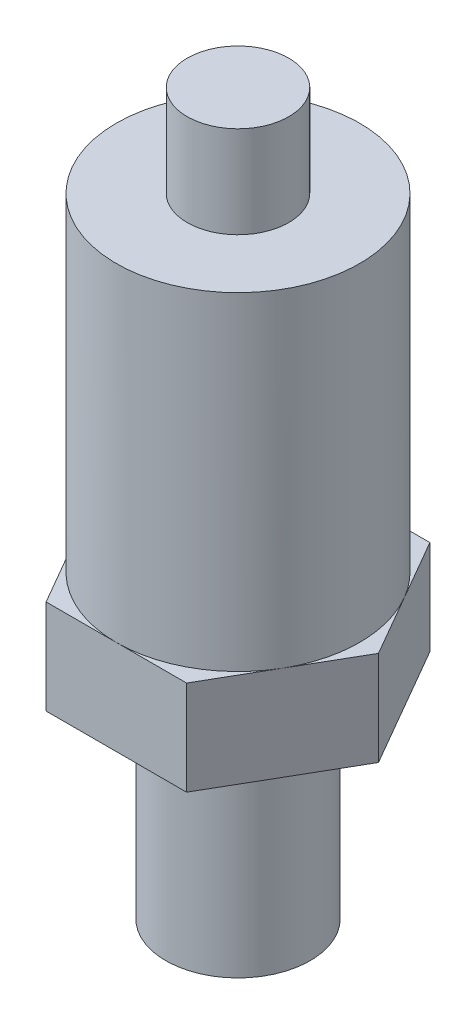
ISO-10303-21;
HEADER;
FILE_DESCRIPTION(('STEP AP214'),'2;1');
FILE_NAME('part.step','',(''),(''),'','','');
FILE_SCHEMA(('AUTOMOTIVE_DESIGN { 1 0 10303 214 1 1 1 1 }'));
ENDSEC;
DATA;
#1=APPLICATION_CONTEXT('core data for automotive mechanical design processes');
#2=APPLICATION_PROTOCOL_DEFINITION('international standard','automotive_design',2000,#1);
#3=PRODUCT_CONTEXT('',#1,'mechanical');
#4=PRODUCT('Part','Part','',(#3));
#5=PRODUCT_RELATED_PRODUCT_CATEGORY('part','',(#4));
#6=PRODUCT_DEFINITION_FORMATION('','',#4);
#7=PRODUCT_DEFINITION_CONTEXT('part definition',#1,'design');
#8=PRODUCT_DEFINITION('design','',#6,#7);
#9=PRODUCT_DEFINITION_SHAPE('','',#8);
#10=(LENGTH_UNIT() NAMED_UNIT(*) SI_UNIT(.MILLI.,.METRE.));
#11=(NAMED_UNIT(*) PLANE_ANGLE_UNIT() SI_UNIT($,.RADIAN.));
#12=(NAMED_UNIT(*) SI_UNIT($,.STERADIAN.) SOLID_ANGLE_UNIT());
#13=UNCERTAINTY_MEASURE_WITH_UNIT(LENGTH_MEASURE(1.E-05),#10,'distance_accuracy_value','');
#14=(GEOMETRIC_REPRESENTATION_CONTEXT(3) GLOBAL_UNCERTAINTY_ASSIGNED_CONTEXT((#13)) GLOBAL_UNIT_ASSIGNED_CONTEXT((#10,
#11,#12)) REPRESENTATION_CONTEXT('',''));
#15=CARTESIAN_POINT('',(0.,0.,0.));
#16=DIRECTION('',(0.,0.,1.));
#17=DIRECTION('',(1.,0.,0.));
#18=AXIS2_PLACEMENT_3D('',#15,#16,#17);
#19=CARTESIAN_POINT('',(11.1125,38.354,0.));
#20=DIRECTION('',(0.,1.,0.));
#21=DIRECTION('',(-1.,0.,0.));
#22=AXIS2_PLACEMENT_3D('',#19,#20,#21);
#23=CYLINDRICAL_SURFACE('',#22,11.1125);
#24=CARTESIAN_POINT('',(11.1125,29.972,0.));
#25=DIRECTION('',(0.,1.,0.));
#26=DIRECTION('',(-1.,0.,0.));
#27=AXIS2_PLACEMENT_3D('',#24,#25,#26);
#28=CIRCLE('',#27,11.1125);
#29=CARTESIAN_POINT('',(0.,29.972,0.));
#30=VERTEX_POINT('',#29);
#31=EDGE_CURVE('E182',#30,#30,#28,.T.);
#32=ORIENTED_EDGE('',*,*,#31,.F.);
#33=EDGE_LOOP('',(#32));
#34=FACE_BOUND('',#33,.T.);
#35=CARTESIAN_POINT('',(11.1125,0.,0.));
#36=DIRECTION('',(0.,-1.,0.));
#37=DIRECTION('',(1.,0.,0.));
#38=AXIS2_PLACEMENT_3D('',#35,#36,#37);
#39=CIRCLE('',#38,11.1125);
#40=CARTESIAN_POINT('',(20.7362072995546,0.,5.55625));
#41=VERTEX_POINT('',#40);
#42=CARTESIAN_POINT('',(20.7362072995546,0.,-5.55625));
#43=VERTEX_POINT('',#42);
#44=EDGE_CURVE('E43',#41,#43,#39,.F.);
#45=ORIENTED_EDGE('',*,*,#44,.T.);
#46=CARTESIAN_POINT('',(11.1125,0.,-11.1125));
#47=VERTEX_POINT('',#46);
#48=EDGE_CURVE('E11',#43,#47,#39,.F.);
#49=ORIENTED_EDGE('',*,*,#48,.T.);
#50=CARTESIAN_POINT('',(1.48879270044544,0.,-5.55625));
#51=VERTEX_POINT('',#50);
#52=EDGE_CURVE('E49',#47,#51,#39,.F.);
#53=ORIENTED_EDGE('',*,*,#52,.T.);
#54=CARTESIAN_POINT('',(1.48879270044543,0.,5.55625));
#55=VERTEX_POINT('',#54);
#56=EDGE_CURVE('E223',#51,#55,#39,.F.);
#57=ORIENTED_EDGE('',*,*,#56,.T.);
#58=CARTESIAN_POINT('',(11.1125,0.,11.1125));
#59=VERTEX_POINT('',#58);
#60=EDGE_CURVE('E220',#55,#59,#39,.F.);
#61=ORIENTED_EDGE('',*,*,#60,.T.);
#62=EDGE_CURVE('E217',#59,#41,#39,.F.);
#63=ORIENTED_EDGE('',*,*,#62,.T.);
#64=EDGE_LOOP('',(#45,#49,#53,#57,#61,#63));
#65=FACE_BOUND('',#64,.T.);
#66=ADVANCED_FACE('F39',(#34,#65),#23,.T.);
#67=CARTESIAN_POINT('',(6.477,38.354,0.));
#68=DIRECTION('',(0.,1.,0.));
#69=DIRECTION('',(-1.,0.,0.));
#70=AXIS2_PLACEMENT_3D('',#67,#68,#69);
#71=PLANE('',#70);
#72=CARTESIAN_POINT('',(11.1125,38.354,0.));
#73=DIRECTION('',(0.,1.,0.));
#74=DIRECTION('',(-1.,0.,0.));
#75=AXIS2_PLACEMENT_3D('',#72,#73,#74);
#76=CIRCLE('',#75,4.6355);
#77=CARTESIAN_POINT('',(6.477,38.354,0.));
#78=VERTEX_POINT('',#77);
#79=EDGE_CURVE('E204',#78,#78,#76,.T.);
#80=ORIENTED_EDGE('',*,*,#79,.T.);
#81=EDGE_LOOP('',(#80));
#82=FACE_BOUND('',#81,.T.);
#83=ADVANCED_FACE('F263',(#82),#71,.T.);
#84=CARTESIAN_POINT('',(11.1125,38.354,0.));
#85=DIRECTION('',(0.,1.,0.));
#86=DIRECTION('',(-1.,0.,0.));
#87=AXIS2_PLACEMENT_3D('',#84,#85,#86);
#88=CYLINDRICAL_SURFACE('',#87,4.6355);
#89=CARTESIAN_POINT('',(11.1125,29.972,0.));
#90=DIRECTION('',(0.,1.,0.));
#91=DIRECTION('',(-1.,0.,0.));
#92=AXIS2_PLACEMENT_3D('',#89,#90,#91);
#93=CIRCLE('',#92,4.6355);
#94=CARTESIAN_POINT('',(6.477,29.972,0.));
#95=VERTEX_POINT('',#94);
#96=EDGE_CURVE('E200',#95,#95,#93,.T.);
#97=ORIENTED_EDGE('',*,*,#96,.T.);
#98=EDGE_LOOP('',(#97));
#99=FACE_BOUND('',#98,.T.);
#100=ORIENTED_EDGE('',*,*,#79,.F.);
#101=EDGE_LOOP('',(#100));
#102=FACE_BOUND('',#101,.T.);
#103=ADVANCED_FACE('F269',(#99,#102),#88,.T.);
#104=CARTESIAN_POINT('',(0.,29.972,0.));
#105=DIRECTION('',(0.,1.,0.));
#106=DIRECTION('',(-1.,0.,0.));
#107=AXIS2_PLACEMENT_3D('',#104,#105,#106);
#108=PLANE('',#107);
#109=ORIENTED_EDGE('',*,*,#31,.T.);
#110=EDGE_LOOP('',(#109));
#111=FACE_BOUND('',#110,.T.);
#112=ORIENTED_EDGE('',*,*,#96,.F.);
#113=EDGE_LOOP('',(#112));
#114=FACE_BOUND('',#113,.T.);
#115=ADVANCED_FACE('F276',(#111,#114),#108,.T.);
#116=CARTESIAN_POINT('',(17.5283048663697,0.,-11.1125));
#117=DIRECTION('',(0.866025403784439,0.,-0.5));
#118=DIRECTION('',(-0.5,0.,-0.866025403784439));
#119=AXIS2_PLACEMENT_3D('',#116,#117,#118);
#120=PLANE('',#119);
#121=DIRECTION('',(0.,-1.,0.));
#122=VECTOR('',#121,1.);
#123=CARTESIAN_POINT('',(23.9441097327394,0.,0.));
#124=LINE('',#123,#122);
#125=CARTESIAN_POINT('',(23.9441097327394,0.,0.));
#126=VERTEX_POINT('',#125);
#127=CARTESIAN_POINT('',(23.9441097327394,-8.636,0.));
#128=VERTEX_POINT('',#127);
#129=EDGE_CURVE('E115',#126,#128,#124,.T.);
#130=ORIENTED_EDGE('',*,*,#129,.T.);
#131=DIRECTION('',(0.5,0.,0.866025403784439));
#132=VECTOR('',#131,1.);
#133=CARTESIAN_POINT('',(17.5283048663697,-8.636,-11.1125));
#134=LINE('',#133,#132);
#135=CARTESIAN_POINT('',(17.5283048663697,-8.636,-11.1125));
#136=VERTEX_POINT('',#135);
#137=EDGE_CURVE('E159',#136,#128,#134,.T.);
#138=ORIENTED_EDGE('',*,*,#137,.F.);
#139=DIRECTION('',(0.,-1.,0.));
#140=VECTOR('',#139,1.);
#141=CARTESIAN_POINT('',(17.5283048663697,0.,-11.1125));
#142=LINE('',#141,#140);
#143=CARTESIAN_POINT('',(17.5283048663697,0.,-11.1125));
#144=VERTEX_POINT('',#143);
#145=EDGE_CURVE('E178',#144,#136,#142,.T.);
#146=ORIENTED_EDGE('',*,*,#145,.F.);
#147=DIRECTION('',(0.5,0.,0.866025403784439));
#148=VECTOR('',#147,1.);
#149=CARTESIAN_POINT('',(17.5283048663697,0.,-11.1125));
#150=LINE('',#149,#148);
#151=EDGE_CURVE('E56',#144,#43,#150,.T.);
#152=ORIENTED_EDGE('',*,*,#151,.T.);
#153=EDGE_CURVE('E111',#43,#126,#150,.T.);
#154=ORIENTED_EDGE('',*,*,#153,.T.);
#155=EDGE_LOOP('',(#130,#138,#146,#152,#154));
#156=FACE_BOUND('',#155,.T.);
#157=ADVANCED_FACE('F113',(#156),#120,.T.);
#158=CARTESIAN_POINT('',(4.69669513363029,0.,-11.1125));
#159=DIRECTION('',(0.,0.,-1.));
#160=DIRECTION('',(-1.,0.,0.));
#161=AXIS2_PLACEMENT_3D('',#158,#159,#160);
#162=PLANE('',#161);
#163=DIRECTION('',(1.,0.,0.));
#164=VECTOR('',#163,1.);
#165=CARTESIAN_POINT('',(4.69669513363029,-8.636,-11.1125));
#166=LINE('',#165,#164);
#167=CARTESIAN_POINT('',(4.69669513363029,-8.636,-11.1125));
#168=VERTEX_POINT('',#167);
#169=EDGE_CURVE('E118',#168,#136,#166,.T.);
#170=ORIENTED_EDGE('',*,*,#169,.F.);
#171=DIRECTION('',(0.,-1.,0.));
#172=VECTOR('',#171,1.);
#173=CARTESIAN_POINT('',(4.69669513363029,0.,-11.1125));
#174=LINE('',#173,#172);
#175=CARTESIAN_POINT('',(4.69669513363029,0.,-11.1125));
#176=VERTEX_POINT('',#175);
#177=EDGE_CURVE('E183',#176,#168,#174,.T.);
#178=ORIENTED_EDGE('',*,*,#177,.F.);
#179=DIRECTION('',(1.,0.,0.));
#180=VECTOR('',#179,1.);
#181=CARTESIAN_POINT('',(4.69669513363029,0.,-11.1125));
#182=LINE('',#181,#180);
#183=EDGE_CURVE('E131',#176,#47,#182,.T.);
#184=ORIENTED_EDGE('',*,*,#183,.T.);
#185=EDGE_CURVE('E155',#47,#144,#182,.T.);
#186=ORIENTED_EDGE('',*,*,#185,.T.);
#187=ORIENTED_EDGE('',*,*,#145,.T.);
#188=EDGE_LOOP('',(#170,#178,#184,#186,#187));
#189=FACE_BOUND('',#188,.T.);
#190=ADVANCED_FACE('F238',(#189),#162,.T.);
#191=CARTESIAN_POINT('',(-1.71910973273943,0.,0.));
#192=DIRECTION('',(-0.866025403784438,0.,-0.5));
#193=DIRECTION('',(-0.5,0.,0.866025403784439));
#194=AXIS2_PLACEMENT_3D('',#191,#192,#193);
#195=PLANE('',#194);
#196=DIRECTION('',(0.5,0.,-0.866025403784438));
#197=VECTOR('',#196,1.);
#198=CARTESIAN_POINT('',(-1.71910973273943,-8.636,0.));
#199=LINE('',#198,#197);
#200=CARTESIAN_POINT('',(-1.71910973273943,-8.636,0.));
#201=VERTEX_POINT('',#200);
#202=EDGE_CURVE('E172',#201,#168,#199,.T.);
#203=ORIENTED_EDGE('',*,*,#202,.F.);
#204=DIRECTION('',(0.,-1.,0.));
#205=VECTOR('',#204,1.);
#206=CARTESIAN_POINT('',(-1.71910973273943,0.,0.));
#207=LINE('',#206,#205);
#208=CARTESIAN_POINT('',(-1.71910973273943,0.,0.));
#209=VERTEX_POINT('',#208);
#210=EDGE_CURVE('E187',#209,#201,#207,.T.);
#211=ORIENTED_EDGE('',*,*,#210,.F.);
#212=DIRECTION('',(0.5,0.,-0.866025403784438));
#213=VECTOR('',#212,1.);
#214=CARTESIAN_POINT('',(-1.71910973273943,0.,0.));
#215=LINE('',#214,#213);
#216=EDGE_CURVE('E151',#209,#51,#215,.T.);
#217=ORIENTED_EDGE('',*,*,#216,.T.);
#218=EDGE_CURVE('E150',#51,#176,#215,.T.);
#219=ORIENTED_EDGE('',*,*,#218,.T.);
#220=ORIENTED_EDGE('',*,*,#177,.T.);
#221=EDGE_LOOP('',(#203,#211,#217,#219,#220));
#222=FACE_BOUND('',#221,.T.);
#223=ADVANCED_FACE('F240',(#222),#195,.T.);
#224=CARTESIAN_POINT('',(4.69669513363029,0.,11.1125));
#225=DIRECTION('',(-0.866025403784438,0.,0.5));
#226=DIRECTION('',(0.5,0.,0.866025403784439));
#227=AXIS2_PLACEMENT_3D('',#224,#225,#226);
#228=PLANE('',#227);
#229=DIRECTION('',(-0.5,0.,-0.866025403784438));
#230=VECTOR('',#229,1.);
#231=CARTESIAN_POINT('',(4.69669513363029,-8.636,11.1125));
#232=LINE('',#231,#230);
#233=CARTESIAN_POINT('',(4.69669513363029,-8.636,11.1125));
#234=VERTEX_POINT('',#233);
#235=EDGE_CURVE('E168',#234,#201,#232,.T.);
#236=ORIENTED_EDGE('',*,*,#235,.F.);
#237=DIRECTION('',(0.,-1.,0.));
#238=VECTOR('',#237,1.);
#239=CARTESIAN_POINT('',(4.69669513363029,0.,11.1125));
#240=LINE('',#239,#238);
#241=CARTESIAN_POINT('',(4.69669513363029,0.,11.1125));
#242=VERTEX_POINT('',#241);
#243=EDGE_CURVE('E191',#242,#234,#240,.T.);
#244=ORIENTED_EDGE('',*,*,#243,.F.);
#245=DIRECTION('',(-0.5,0.,-0.866025403784438));
#246=VECTOR('',#245,1.);
#247=CARTESIAN_POINT('',(4.69669513363029,0.,11.1125));
#248=LINE('',#247,#246);
#249=EDGE_CURVE('E146',#242,#55,#248,.T.);
#250=ORIENTED_EDGE('',*,*,#249,.T.);
#251=EDGE_CURVE('E145',#55,#209,#248,.T.);
#252=ORIENTED_EDGE('',*,*,#251,.T.);
#253=ORIENTED_EDGE('',*,*,#210,.T.);
#254=EDGE_LOOP('',(#236,#244,#250,#252,#253));
#255=FACE_BOUND('',#254,.T.);
#256=ADVANCED_FACE('F247',(#255),#228,.T.);
#257=CARTESIAN_POINT('',(17.5283048663697,0.,11.1125));
#258=DIRECTION('',(0.,0.,1.));
#259=DIRECTION('',(1.,0.,0.));
#260=AXIS2_PLACEMENT_3D('',#257,#258,#259);
#261=PLANE('',#260);
#262=DIRECTION('',(-1.,0.,0.));
#263=VECTOR('',#262,1.);
#264=CARTESIAN_POINT('',(17.5283048663697,-8.636,11.1125));
#265=LINE('',#264,#263);
#266=CARTESIAN_POINT('',(17.5283048663697,-8.636,11.1125));
#267=VERTEX_POINT('',#266);
#268=EDGE_CURVE('E164',#267,#234,#265,.T.);
#269=ORIENTED_EDGE('',*,*,#268,.F.);
#270=DIRECTION('',(0.,-1.,0.));
#271=VECTOR('',#270,1.);
#272=CARTESIAN_POINT('',(17.5283048663697,0.,11.1125));
#273=LINE('',#272,#271);
#274=CARTESIAN_POINT('',(17.5283048663697,0.,11.1125));
#275=VERTEX_POINT('',#274);
#276=EDGE_CURVE('E130',#275,#267,#273,.T.);
#277=ORIENTED_EDGE('',*,*,#276,.F.);
#278=DIRECTION('',(-1.,0.,0.));
#279=VECTOR('',#278,1.);
#280=CARTESIAN_POINT('',(17.5283048663697,0.,11.1125));
#281=LINE('',#280,#279);
#282=EDGE_CURVE('E140',#275,#59,#281,.T.);
#283=ORIENTED_EDGE('',*,*,#282,.T.);
#284=EDGE_CURVE('E135',#59,#242,#281,.T.);
#285=ORIENTED_EDGE('',*,*,#284,.T.);
#286=ORIENTED_EDGE('',*,*,#243,.T.);
#287=EDGE_LOOP('',(#269,#277,#283,#285,#286));
#288=FACE_BOUND('',#287,.T.);
#289=ADVANCED_FACE('F300',(#288),#261,.T.);
#290=CARTESIAN_POINT('',(23.9441097327394,0.,0.));
#291=DIRECTION('',(0.866025403784438,0.,0.5));
#292=DIRECTION('',(0.5,0.,-0.866025403784439));
#293=AXIS2_PLACEMENT_3D('',#290,#291,#292);
#294=PLANE('',#293);
#295=DIRECTION('',(-0.5,0.,0.866025403784438));
#296=VECTOR('',#295,1.);
#297=CARTESIAN_POINT('',(23.9441097327394,-8.636,0.));
#298=LINE('',#297,#296);
#299=EDGE_CURVE('E127',#128,#267,#298,.T.);
#300=ORIENTED_EDGE('',*,*,#299,.F.);
#301=ORIENTED_EDGE('',*,*,#129,.F.);
#302=DIRECTION('',(-0.5,0.,0.866025403784438));
#303=VECTOR('',#302,1.);
#304=CARTESIAN_POINT('',(23.9441097327394,0.,0.));
#305=LINE('',#304,#303);
#306=EDGE_CURVE('E123',#126,#41,#305,.T.);
#307=ORIENTED_EDGE('',*,*,#306,.T.);
#308=EDGE_CURVE('E136',#41,#275,#305,.T.);
#309=ORIENTED_EDGE('',*,*,#308,.T.);
#310=ORIENTED_EDGE('',*,*,#276,.T.);
#311=EDGE_LOOP('',(#300,#301,#307,#309,#310));
#312=FACE_BOUND('',#311,.T.);
#313=ADVANCED_FACE('F122',(#312),#294,.T.);
#314=CARTESIAN_POINT('',(0.,0.,0.));
#315=DIRECTION('',(0.,-1.,0.));
#316=DIRECTION('',(1.,0.,0.));
#317=AXIS2_PLACEMENT_3D('',#314,#315,#316);
#318=PLANE('',#317);
#319=ORIENTED_EDGE('',*,*,#48,.F.);
#320=ORIENTED_EDGE('',*,*,#151,.F.);
#321=ORIENTED_EDGE('',*,*,#185,.F.);
#322=EDGE_LOOP('',(#319,#320,#321));
#323=FACE_BOUND('',#322,.T.);
#324=ADVANCED_FACE('F234',(#323),#318,.F.);
#325=ORIENTED_EDGE('',*,*,#52,.F.);
#326=ORIENTED_EDGE('',*,*,#183,.F.);
#327=ORIENTED_EDGE('',*,*,#218,.F.);
#328=EDGE_LOOP('',(#325,#326,#327));
#329=FACE_BOUND('',#328,.T.);
#330=ADVANCED_FACE('F232',(#329),#318,.F.);
#331=ORIENTED_EDGE('',*,*,#56,.F.);
#332=ORIENTED_EDGE('',*,*,#216,.F.);
#333=ORIENTED_EDGE('',*,*,#251,.F.);
#334=EDGE_LOOP('',(#331,#332,#333));
#335=FACE_BOUND('',#334,.T.);
#336=ADVANCED_FACE('F251',(#335),#318,.F.);
#337=ORIENTED_EDGE('',*,*,#60,.F.);
#338=ORIENTED_EDGE('',*,*,#249,.F.);
#339=ORIENTED_EDGE('',*,*,#284,.F.);
#340=EDGE_LOOP('',(#337,#338,#339));
#341=FACE_BOUND('',#340,.T.);
#342=ADVANCED_FACE('F253',(#341),#318,.F.);
#343=ORIENTED_EDGE('',*,*,#62,.F.);
#344=ORIENTED_EDGE('',*,*,#282,.F.);
#345=ORIENTED_EDGE('',*,*,#308,.F.);
#346=EDGE_LOOP('',(#343,#344,#345));
#347=FACE_BOUND('',#346,.T.);
#348=ADVANCED_FACE('F259',(#347),#318,.F.);
#349=ORIENTED_EDGE('',*,*,#44,.F.);
#350=ORIENTED_EDGE('',*,*,#306,.F.);
#351=ORIENTED_EDGE('',*,*,#153,.F.);
#352=EDGE_LOOP('',(#349,#350,#351));
#353=FACE_BOUND('',#352,.T.);
#354=ADVANCED_FACE('F133',(#353),#318,.F.);
#355=CARTESIAN_POINT('',(4.51250000000001,-27.432,0.));
#356=DIRECTION('',(0.,-1.,0.));
#357=DIRECTION('',(1.,0.,0.));
#358=AXIS2_PLACEMENT_3D('',#355,#356,#357);
#359=PLANE('',#358);
#360=CARTESIAN_POINT('',(11.1125,-27.432,0.));
#361=DIRECTION('',(0.,1.,0.));
#362=DIRECTION('',(-1.,0.,0.));
#363=AXIS2_PLACEMENT_3D('',#360,#361,#362);
#364=CIRCLE('',#363,6.6);
#365=CARTESIAN_POINT('',(4.51250000000001,-27.432,0.));
#366=VERTEX_POINT('',#365);
#367=EDGE_CURVE('E208',#366,#366,#364,.T.);
#368=ORIENTED_EDGE('',*,*,#367,.F.);
#369=EDGE_LOOP('',(#368));
#370=FACE_BOUND('',#369,.T.);
#371=ADVANCED_FACE('F283',(#370),#359,.T.);
#372=CARTESIAN_POINT('',(11.1125,38.354,0.));
#373=DIRECTION('',(0.,1.,0.));
#374=DIRECTION('',(-1.,0.,0.));
#375=AXIS2_PLACEMENT_3D('',#372,#373,#374);
#376=CYLINDRICAL_SURFACE('',#375,6.6);
#377=ORIENTED_EDGE('',*,*,#367,.T.);
#378=EDGE_LOOP('',(#377));
#379=FACE_BOUND('',#378,.T.);
#380=CARTESIAN_POINT('',(11.1125,-8.636,0.));
#381=DIRECTION('',(0.,1.,0.));
#382=DIRECTION('',(-1.,0.,0.));
#383=AXIS2_PLACEMENT_3D('',#380,#381,#382);
#384=CIRCLE('',#383,6.6);
#385=CARTESIAN_POINT('',(4.51250000000001,-8.636,0.));
#386=VERTEX_POINT('',#385);
#387=EDGE_CURVE('E211',#386,#386,#384,.T.);
#388=ORIENTED_EDGE('',*,*,#387,.F.);
#389=EDGE_LOOP('',(#388));
#390=FACE_BOUND('',#389,.T.);
#391=ADVANCED_FACE('F285',(#379,#390),#376,.T.);
#392=CARTESIAN_POINT('',(0.,-8.636,0.));
#393=DIRECTION('',(0.,-1.,0.));
#394=DIRECTION('',(1.,0.,0.));
#395=AXIS2_PLACEMENT_3D('',#392,#393,#394);
#396=PLANE('',#395);
#397=ORIENTED_EDGE('',*,*,#387,.T.);
#398=EDGE_LOOP('',(#397));
#399=FACE_BOUND('',#398,.T.);
#400=ORIENTED_EDGE('',*,*,#299,.T.);
#401=ORIENTED_EDGE('',*,*,#268,.T.);
#402=ORIENTED_EDGE('',*,*,#235,.T.);
#403=ORIENTED_EDGE('',*,*,#202,.T.);
#404=ORIENTED_EDGE('',*,*,#169,.T.);
#405=ORIENTED_EDGE('',*,*,#137,.T.);
#406=EDGE_LOOP('',(#400,#401,#402,#403,#404,#405));
#407=FACE_BOUND('',#406,.T.);
#408=ADVANCED_FACE('F41',(#399,#407),#396,.T.);
#409=CLOSED_SHELL('',(#66,#83,#103,#115,#157,#190,#223,#256,#289,#313,#324,#330,#336,#342,#348,
#354,#371,#391,#408));
#410=MANIFOLD_SOLID_BREP('B2',#409);
#411=ADVANCED_BREP_SHAPE_REPRESENTATION('',(#18,#410),#14);
#412=SHAPE_DEFINITION_REPRESENTATION(#9,#411);
ENDSEC;
END-ISO-10303-21;
